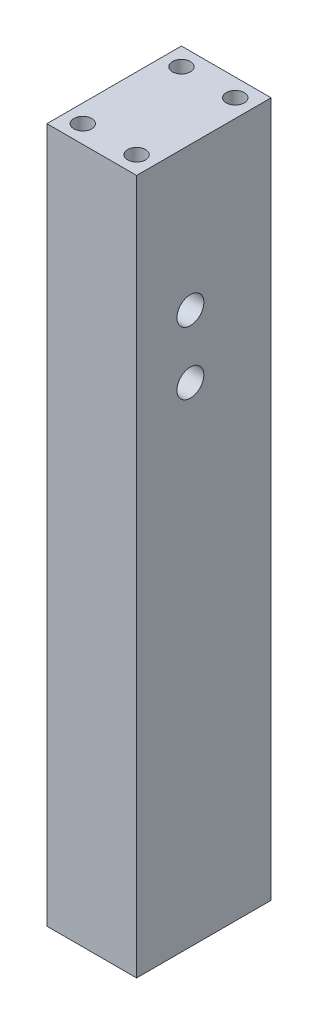
ISO-10303-21;
HEADER;
FILE_DESCRIPTION(('STEP AP214'),'2;1');
FILE_NAME('part.step','',(''),(''),'','','');
FILE_SCHEMA(('AUTOMOTIVE_DESIGN { 1 0 10303 214 1 1 1 1 }'));
ENDSEC;
DATA;
#1=APPLICATION_CONTEXT('core data for automotive mechanical design processes');
#2=APPLICATION_PROTOCOL_DEFINITION('international standard','automotive_design',2000,#1);
#3=PRODUCT_CONTEXT('',#1,'mechanical');
#4=PRODUCT('Part','Part','',(#3));
#5=PRODUCT_RELATED_PRODUCT_CATEGORY('part','',(#4));
#6=PRODUCT_DEFINITION_FORMATION('','',#4);
#7=PRODUCT_DEFINITION_CONTEXT('part definition',#1,'design');
#8=PRODUCT_DEFINITION('design','',#6,#7);
#9=PRODUCT_DEFINITION_SHAPE('','',#8);
#10=(LENGTH_UNIT() NAMED_UNIT(*) SI_UNIT(.MILLI.,.METRE.));
#11=(NAMED_UNIT(*) PLANE_ANGLE_UNIT() SI_UNIT($,.RADIAN.));
#12=(NAMED_UNIT(*) SI_UNIT($,.STERADIAN.) SOLID_ANGLE_UNIT());
#13=UNCERTAINTY_MEASURE_WITH_UNIT(LENGTH_MEASURE(1.E-05),#10,'distance_accuracy_value','');
#14=(GEOMETRIC_REPRESENTATION_CONTEXT(3) GLOBAL_UNCERTAINTY_ASSIGNED_CONTEXT((#13)) GLOBAL_UNIT_ASSIGNED_CONTEXT((#10,
#11,#12)) REPRESENTATION_CONTEXT('',''));
#15=CARTESIAN_POINT('',(0.,0.,0.));
#16=DIRECTION('',(0.,0.,1.));
#17=DIRECTION('',(1.,0.,0.));
#18=AXIS2_PLACEMENT_3D('',#15,#16,#17);
#19=CARTESIAN_POINT('',(10.,0.,0.));
#20=DIRECTION('',(-1.,0.,0.));
#21=DIRECTION('',(0.,0.,1.));
#22=AXIS2_PLACEMENT_3D('',#19,#20,#21);
#23=PLANE('',#22);
#24=DIRECTION('',(0.,-1.,0.));
#25=VECTOR('',#24,1.);
#26=CARTESIAN_POINT('',(10.,0.,0.));
#27=LINE('',#26,#25);
#28=CARTESIAN_POINT('',(10.,77.5,0.));
#29=VERTEX_POINT('',#28);
#30=CARTESIAN_POINT('',(10.,0.,0.));
#31=VERTEX_POINT('',#30);
#32=EDGE_CURVE('E84',#29,#31,#27,.T.);
#33=ORIENTED_EDGE('',*,*,#32,.T.);
#34=DIRECTION('',(0.,0.,-1.));
#35=VECTOR('',#34,1.);
#36=CARTESIAN_POINT('',(10.,0.,0.));
#37=LINE('',#36,#35);
#38=CARTESIAN_POINT('',(10.,0.,-15.));
#39=VERTEX_POINT('',#38);
#40=EDGE_CURVE('E79',#31,#39,#37,.T.);
#41=ORIENTED_EDGE('',*,*,#40,.T.);
#42=DIRECTION('',(0.,1.,0.));
#43=VECTOR('',#42,1.);
#44=CARTESIAN_POINT('',(10.,0.,-15.));
#45=LINE('',#44,#43);
#46=CARTESIAN_POINT('',(10.,77.5,-15.));
#47=VERTEX_POINT('',#46);
#48=EDGE_CURVE('E82',#39,#47,#45,.T.);
#49=ORIENTED_EDGE('',*,*,#48,.T.);
#50=DIRECTION('',(0.,0.,1.));
#51=VECTOR('',#50,1.);
#52=CARTESIAN_POINT('',(10.,77.5,0.));
#53=LINE('',#52,#51);
#54=EDGE_CURVE('E49',#47,#29,#53,.T.);
#55=ORIENTED_EDGE('',*,*,#54,.T.);
#56=EDGE_LOOP('',(#33,#41,#49,#55));
#57=FACE_BOUND('',#56,.T.);
#58=CARTESIAN_POINT('',(10.,54.5,-6.));
#59=DIRECTION('',(-1.,0.,0.));
#60=DIRECTION('',(0.,0.,1.));
#61=AXIS2_PLACEMENT_3D('',#58,#59,#60);
#62=CIRCLE('',#61,1.5);
#63=CARTESIAN_POINT('',(10.,54.5,-4.5));
#64=VERTEX_POINT('',#63);
#65=EDGE_CURVE('E163',#64,#64,#62,.T.);
#66=ORIENTED_EDGE('',*,*,#65,.T.);
#67=EDGE_LOOP('',(#66));
#68=FACE_BOUND('',#67,.T.);
#69=CARTESIAN_POINT('',(10.,61.5,-6.));
#70=DIRECTION('',(1.,0.,0.));
#71=DIRECTION('',(0.,0.,-1.));
#72=AXIS2_PLACEMENT_3D('',#69,#70,#71);
#73=CIRCLE('',#72,1.5);
#74=CARTESIAN_POINT('',(10.,61.5,-7.5));
#75=VERTEX_POINT('',#74);
#76=EDGE_CURVE('E166',#75,#75,#73,.T.);
#77=ORIENTED_EDGE('',*,*,#76,.F.);
#78=EDGE_LOOP('',(#77));
#79=FACE_BOUND('',#78,.T.);
#80=ADVANCED_FACE('F32',(#57,#68,#79),#23,.F.);
#81=CARTESIAN_POINT('',(10.,0.,0.));
#82=DIRECTION('',(0.,1.,0.));
#83=DIRECTION('',(0.,0.,1.));
#84=AXIS2_PLACEMENT_3D('',#81,#82,#83);
#85=PLANE('',#84);
#86=CARTESIAN_POINT('',(8.,0.,-13.));
#87=DIRECTION('',(0.,-1.,0.));
#88=DIRECTION('',(0.,0.,-1.));
#89=AXIS2_PLACEMENT_3D('',#86,#87,#88);
#90=CIRCLE('',#89,1.);
#91=CARTESIAN_POINT('',(8.,0.,-14.));
#92=VERTEX_POINT('',#91);
#93=EDGE_CURVE('E139',#92,#92,#90,.T.);
#94=ORIENTED_EDGE('',*,*,#93,.F.);
#95=EDGE_LOOP('',(#94));
#96=FACE_BOUND('',#95,.T.);
#97=CARTESIAN_POINT('',(8.,0.,-2.));
#98=DIRECTION('',(0.,-1.,0.));
#99=DIRECTION('',(0.,0.,-1.));
#100=AXIS2_PLACEMENT_3D('',#97,#98,#99);
#101=CIRCLE('',#100,1.);
#102=CARTESIAN_POINT('',(8.,0.,-3.));
#103=VERTEX_POINT('',#102);
#104=EDGE_CURVE('E136',#103,#103,#101,.F.);
#105=ORIENTED_EDGE('',*,*,#104,.T.);
#106=EDGE_LOOP('',(#105));
#107=FACE_BOUND('',#106,.T.);
#108=DIRECTION('',(0.,0.,-1.));
#109=VECTOR('',#108,1.);
#110=CARTESIAN_POINT('',(0.,0.,0.));
#111=LINE('',#110,#109);
#112=CARTESIAN_POINT('',(0.,0.,0.));
#113=VERTEX_POINT('',#112);
#114=CARTESIAN_POINT('',(0.,0.,-15.));
#115=VERTEX_POINT('',#114);
#116=EDGE_CURVE('E89',#113,#115,#111,.T.);
#117=ORIENTED_EDGE('',*,*,#116,.T.);
#118=DIRECTION('',(-1.,0.,0.));
#119=VECTOR('',#118,1.);
#120=CARTESIAN_POINT('',(10.,0.,-15.));
#121=LINE('',#120,#119);
#122=EDGE_CURVE('E41',#39,#115,#121,.T.);
#123=ORIENTED_EDGE('',*,*,#122,.F.);
#124=ORIENTED_EDGE('',*,*,#40,.F.);
#125=DIRECTION('',(-1.,0.,0.));
#126=VECTOR('',#125,1.);
#127=CARTESIAN_POINT('',(10.,0.,0.));
#128=LINE('',#127,#126);
#129=EDGE_CURVE('E11',#31,#113,#128,.T.);
#130=ORIENTED_EDGE('',*,*,#129,.T.);
#131=EDGE_LOOP('',(#117,#123,#124,#130));
#132=FACE_BOUND('',#131,.T.);
#133=CARTESIAN_POINT('',(2.,0.,-13.));
#134=DIRECTION('',(0.,-1.,0.));
#135=DIRECTION('',(0.,0.,-1.));
#136=AXIS2_PLACEMENT_3D('',#133,#134,#135);
#137=CIRCLE('',#136,1.);
#138=CARTESIAN_POINT('',(2.,0.,-14.));
#139=VERTEX_POINT('',#138);
#140=EDGE_CURVE('E152',#139,#139,#137,.F.);
#141=ORIENTED_EDGE('',*,*,#140,.T.);
#142=EDGE_LOOP('',(#141));
#143=FACE_BOUND('',#142,.T.);
#144=CARTESIAN_POINT('',(2.,0.,-2.));
#145=DIRECTION('',(0.,-1.,0.));
#146=DIRECTION('',(0.,0.,-1.));
#147=AXIS2_PLACEMENT_3D('',#144,#145,#146);
#148=CIRCLE('',#147,1.);
#149=CARTESIAN_POINT('',(2.,0.,-3.));
#150=VERTEX_POINT('',#149);
#151=EDGE_CURVE('E145',#150,#150,#148,.T.);
#152=ORIENTED_EDGE('',*,*,#151,.F.);
#153=EDGE_LOOP('',(#152));
#154=FACE_BOUND('',#153,.T.);
#155=ADVANCED_FACE('F87',(#96,#107,#132,#143,#154),#85,.F.);
#156=CARTESIAN_POINT('',(10.,77.5,0.));
#157=DIRECTION('',(0.,-1.,0.));
#158=DIRECTION('',(0.,0.,-1.));
#159=AXIS2_PLACEMENT_3D('',#156,#157,#158);
#160=PLANE('',#159);
#161=CARTESIAN_POINT('',(8.,77.5,-2.));
#162=DIRECTION('',(0.,1.,0.));
#163=DIRECTION('',(0.,0.,1.));
#164=AXIS2_PLACEMENT_3D('',#161,#162,#163);
#165=CIRCLE('',#164,1.);
#166=CARTESIAN_POINT('',(8.,77.5,-1.));
#167=VERTEX_POINT('',#166);
#168=EDGE_CURVE('E125',#167,#167,#165,.T.);
#169=ORIENTED_EDGE('',*,*,#168,.F.);
#170=EDGE_LOOP('',(#169));
#171=FACE_BOUND('',#170,.T.);
#172=CARTESIAN_POINT('',(2.,77.5,-13.));
#173=DIRECTION('',(0.,1.,0.));
#174=DIRECTION('',(0.,0.,1.));
#175=AXIS2_PLACEMENT_3D('',#172,#173,#174);
#176=CIRCLE('',#175,1.);
#177=CARTESIAN_POINT('',(2.,77.5,-12.));
#178=VERTEX_POINT('',#177);
#179=EDGE_CURVE('E112',#178,#178,#176,.T.);
#180=ORIENTED_EDGE('',*,*,#179,.F.);
#181=EDGE_LOOP('',(#180));
#182=FACE_BOUND('',#181,.T.);
#183=DIRECTION('',(0.,0.,1.));
#184=VECTOR('',#183,1.);
#185=CARTESIAN_POINT('',(0.,77.5,0.));
#186=LINE('',#185,#184);
#187=CARTESIAN_POINT('',(0.,77.5,-15.));
#188=VERTEX_POINT('',#187);
#189=CARTESIAN_POINT('',(0.,77.5,0.));
#190=VERTEX_POINT('',#189);
#191=EDGE_CURVE('E72',#188,#190,#186,.T.);
#192=ORIENTED_EDGE('',*,*,#191,.T.);
#193=DIRECTION('',(-1.,0.,0.));
#194=VECTOR('',#193,1.);
#195=CARTESIAN_POINT('',(10.,77.5,0.));
#196=LINE('',#195,#194);
#197=EDGE_CURVE('E93',#29,#190,#196,.T.);
#198=ORIENTED_EDGE('',*,*,#197,.F.);
#199=ORIENTED_EDGE('',*,*,#54,.F.);
#200=DIRECTION('',(-1.,0.,0.));
#201=VECTOR('',#200,1.);
#202=CARTESIAN_POINT('',(10.,77.5,-15.));
#203=LINE('',#202,#201);
#204=EDGE_CURVE('E90',#47,#188,#203,.T.);
#205=ORIENTED_EDGE('',*,*,#204,.T.);
#206=EDGE_LOOP('',(#192,#198,#199,#205));
#207=FACE_BOUND('',#206,.T.);
#208=CARTESIAN_POINT('',(8.,77.5,-13.));
#209=DIRECTION('',(0.,1.,0.));
#210=DIRECTION('',(0.,0.,1.));
#211=AXIS2_PLACEMENT_3D('',#208,#209,#210);
#212=CIRCLE('',#211,1.);
#213=CARTESIAN_POINT('',(8.,77.5,-12.));
#214=VERTEX_POINT('',#213);
#215=EDGE_CURVE('E131',#214,#214,#212,.F.);
#216=ORIENTED_EDGE('',*,*,#215,.T.);
#217=EDGE_LOOP('',(#216));
#218=FACE_BOUND('',#217,.T.);
#219=CARTESIAN_POINT('',(2.,77.5,-2.));
#220=DIRECTION('',(0.,1.,0.));
#221=DIRECTION('',(0.,0.,1.));
#222=AXIS2_PLACEMENT_3D('',#219,#220,#221);
#223=CIRCLE('',#222,1.);
#224=CARTESIAN_POINT('',(2.,77.5,-1.));
#225=VERTEX_POINT('',#224);
#226=EDGE_CURVE('E118',#225,#225,#223,.F.);
#227=ORIENTED_EDGE('',*,*,#226,.T.);
#228=EDGE_LOOP('',(#227));
#229=FACE_BOUND('',#228,.T.);
#230=ADVANCED_FACE('F105',(#171,#182,#207,#218,#229),#160,.F.);
#231=CARTESIAN_POINT('',(10.,0.,0.));
#232=DIRECTION('',(0.,0.,-1.));
#233=DIRECTION('',(-1.,0.,0.));
#234=AXIS2_PLACEMENT_3D('',#231,#232,#233);
#235=PLANE('',#234);
#236=DIRECTION('',(0.,-1.,0.));
#237=VECTOR('',#236,1.);
#238=CARTESIAN_POINT('',(0.,0.,0.));
#239=LINE('',#238,#237);
#240=EDGE_CURVE('E97',#190,#113,#239,.T.);
#241=ORIENTED_EDGE('',*,*,#240,.T.);
#242=ORIENTED_EDGE('',*,*,#129,.F.);
#243=ORIENTED_EDGE('',*,*,#32,.F.);
#244=ORIENTED_EDGE('',*,*,#197,.T.);
#245=EDGE_LOOP('',(#241,#242,#243,#244));
#246=FACE_BOUND('',#245,.T.);
#247=ADVANCED_FACE('F34',(#246),#235,.F.);
#248=CARTESIAN_POINT('',(10.,0.,-15.));
#249=DIRECTION('',(0.,0.,1.));
#250=DIRECTION('',(0.,-1.,0.));
#251=AXIS2_PLACEMENT_3D('',#248,#249,#250);
#252=PLANE('',#251);
#253=DIRECTION('',(0.,1.,0.));
#254=VECTOR('',#253,1.);
#255=CARTESIAN_POINT('',(0.,0.,-15.));
#256=LINE('',#255,#254);
#257=EDGE_CURVE('E66',#115,#188,#256,.T.);
#258=ORIENTED_EDGE('',*,*,#257,.T.);
#259=ORIENTED_EDGE('',*,*,#204,.F.);
#260=ORIENTED_EDGE('',*,*,#48,.F.);
#261=ORIENTED_EDGE('',*,*,#122,.T.);
#262=EDGE_LOOP('',(#258,#259,#260,#261));
#263=FACE_BOUND('',#262,.T.);
#264=ADVANCED_FACE('F91',(#263),#252,.F.);
#265=CARTESIAN_POINT('',(0.,0.,0.));
#266=DIRECTION('',(-1.,0.,0.));
#267=DIRECTION('',(0.,0.,1.));
#268=AXIS2_PLACEMENT_3D('',#265,#266,#267);
#269=PLANE('',#268);
#270=ORIENTED_EDGE('',*,*,#240,.F.);
#271=ORIENTED_EDGE('',*,*,#191,.F.);
#272=ORIENTED_EDGE('',*,*,#257,.F.);
#273=ORIENTED_EDGE('',*,*,#116,.F.);
#274=EDGE_LOOP('',(#270,#271,#272,#273));
#275=FACE_BOUND('',#274,.T.);
#276=ADVANCED_FACE('F109',(#275),#269,.T.);
#277=CARTESIAN_POINT('',(2.,67.5,-13.));
#278=DIRECTION('',(0.,1.,0.));
#279=DIRECTION('',(0.,0.,1.));
#280=AXIS2_PLACEMENT_3D('',#277,#278,#279);
#281=CYLINDRICAL_SURFACE('',#280,1.);
#282=CARTESIAN_POINT('',(2.,67.5,-13.));
#283=DIRECTION('',(0.,1.,0.));
#284=DIRECTION('',(0.,0.,1.));
#285=AXIS2_PLACEMENT_3D('',#282,#283,#284);
#286=CIRCLE('',#285,1.);
#287=CARTESIAN_POINT('',(2.,67.5,-12.));
#288=VERTEX_POINT('',#287);
#289=EDGE_CURVE('E100',#288,#288,#286,.T.);
#290=ORIENTED_EDGE('',*,*,#289,.F.);
#291=EDGE_LOOP('',(#290));
#292=FACE_BOUND('',#291,.T.);
#293=ORIENTED_EDGE('',*,*,#179,.T.);
#294=EDGE_LOOP('',(#293));
#295=FACE_BOUND('',#294,.T.);
#296=ADVANCED_FACE('F189',(#292,#295),#281,.F.);
#297=CARTESIAN_POINT('',(0.,67.5,0.));
#298=DIRECTION('',(0.,1.,0.));
#299=DIRECTION('',(0.,0.,1.));
#300=AXIS2_PLACEMENT_3D('',#297,#298,#299);
#301=PLANE('',#300);
#302=ORIENTED_EDGE('',*,*,#289,.T.);
#303=EDGE_LOOP('',(#302));
#304=FACE_BOUND('',#303,.T.);
#305=ADVANCED_FACE('F348',(#304),#301,.T.);
#306=CARTESIAN_POINT('',(8.,67.5,-13.));
#307=DIRECTION('',(0.,1.,0.));
#308=DIRECTION('',(0.,0.,1.));
#309=AXIS2_PLACEMENT_3D('',#306,#307,#308);
#310=CYLINDRICAL_SURFACE('',#309,1.);
#311=CARTESIAN_POINT('',(8.,67.5,-13.));
#312=DIRECTION('',(0.,1.,0.));
#313=DIRECTION('',(0.,0.,1.));
#314=AXIS2_PLACEMENT_3D('',#311,#312,#313);
#315=CIRCLE('',#314,1.);
#316=CARTESIAN_POINT('',(8.,67.5,-12.));
#317=VERTEX_POINT('',#316);
#318=EDGE_CURVE('E115',#317,#317,#315,.F.);
#319=ORIENTED_EDGE('',*,*,#318,.T.);
#320=EDGE_LOOP('',(#319));
#321=FACE_BOUND('',#320,.T.);
#322=ORIENTED_EDGE('',*,*,#215,.F.);
#323=EDGE_LOOP('',(#322));
#324=FACE_BOUND('',#323,.T.);
#325=ADVANCED_FACE('F344',(#321,#324),#310,.F.);
#326=CARTESIAN_POINT('',(0.,67.5,0.));
#327=DIRECTION('',(0.,1.,0.));
#328=DIRECTION('',(0.,0.,1.));
#329=AXIS2_PLACEMENT_3D('',#326,#327,#328);
#330=PLANE('',#329);
#331=ORIENTED_EDGE('',*,*,#318,.F.);
#332=EDGE_LOOP('',(#331));
#333=FACE_BOUND('',#332,.T.);
#334=ADVANCED_FACE('F340',(#333),#330,.T.);
#335=CARTESIAN_POINT('',(8.,67.5,-2.));
#336=DIRECTION('',(0.,1.,0.));
#337=DIRECTION('',(0.,0.,1.));
#338=AXIS2_PLACEMENT_3D('',#335,#336,#337);
#339=CYLINDRICAL_SURFACE('',#338,1.);
#340=CARTESIAN_POINT('',(8.,67.5,-2.));
#341=DIRECTION('',(0.,1.,0.));
#342=DIRECTION('',(0.,0.,1.));
#343=AXIS2_PLACEMENT_3D('',#340,#341,#342);
#344=CIRCLE('',#343,1.);
#345=CARTESIAN_POINT('',(8.,67.5,-1.));
#346=VERTEX_POINT('',#345);
#347=EDGE_CURVE('E128',#346,#346,#344,.T.);
#348=ORIENTED_EDGE('',*,*,#347,.F.);
#349=EDGE_LOOP('',(#348));
#350=FACE_BOUND('',#349,.T.);
#351=ORIENTED_EDGE('',*,*,#168,.T.);
#352=EDGE_LOOP('',(#351));
#353=FACE_BOUND('',#352,.T.);
#354=ADVANCED_FACE('F343',(#350,#353),#339,.F.);
#355=CARTESIAN_POINT('',(0.,67.5,0.));
#356=DIRECTION('',(0.,1.,0.));
#357=DIRECTION('',(0.,0.,1.));
#358=AXIS2_PLACEMENT_3D('',#355,#356,#357);
#359=PLANE('',#358);
#360=ORIENTED_EDGE('',*,*,#347,.T.);
#361=EDGE_LOOP('',(#360));
#362=FACE_BOUND('',#361,.T.);
#363=ADVANCED_FACE('F350',(#362),#359,.T.);
#364=CARTESIAN_POINT('',(2.,67.5,-2.));
#365=DIRECTION('',(0.,1.,0.));
#366=DIRECTION('',(0.,0.,1.));
#367=AXIS2_PLACEMENT_3D('',#364,#365,#366);
#368=CYLINDRICAL_SURFACE('',#367,1.);
#369=CARTESIAN_POINT('',(2.,67.5,-2.));
#370=DIRECTION('',(0.,1.,0.));
#371=DIRECTION('',(0.,0.,1.));
#372=AXIS2_PLACEMENT_3D('',#369,#370,#371);
#373=CIRCLE('',#372,1.);
#374=CARTESIAN_POINT('',(2.,67.5,-1.));
#375=VERTEX_POINT('',#374);
#376=EDGE_CURVE('E121',#375,#375,#373,.F.);
#377=ORIENTED_EDGE('',*,*,#376,.T.);
#378=EDGE_LOOP('',(#377));
#379=FACE_BOUND('',#378,.T.);
#380=ORIENTED_EDGE('',*,*,#226,.F.);
#381=EDGE_LOOP('',(#380));
#382=FACE_BOUND('',#381,.T.);
#383=ADVANCED_FACE('F353',(#379,#382),#368,.F.);
#384=CARTESIAN_POINT('',(0.,67.5,0.));
#385=DIRECTION('',(0.,1.,0.));
#386=DIRECTION('',(0.,0.,1.));
#387=AXIS2_PLACEMENT_3D('',#384,#385,#386);
#388=PLANE('',#387);
#389=ORIENTED_EDGE('',*,*,#376,.F.);
#390=EDGE_LOOP('',(#389));
#391=FACE_BOUND('',#390,.T.);
#392=ADVANCED_FACE('F220',(#391),#388,.T.);
#393=CARTESIAN_POINT('',(8.,10.,-2.));
#394=DIRECTION('',(0.,-1.,0.));
#395=DIRECTION('',(0.,0.,-1.));
#396=AXIS2_PLACEMENT_3D('',#393,#394,#395);
#397=CYLINDRICAL_SURFACE('',#396,1.);
#398=CARTESIAN_POINT('',(8.,10.,-2.));
#399=DIRECTION('',(0.,-1.,0.));
#400=DIRECTION('',(0.,0.,-1.));
#401=AXIS2_PLACEMENT_3D('',#398,#399,#400);
#402=CIRCLE('',#401,1.);
#403=CARTESIAN_POINT('',(8.,10.,-3.));
#404=VERTEX_POINT('',#403);
#405=EDGE_CURVE('E122',#404,#404,#402,.F.);
#406=ORIENTED_EDGE('',*,*,#405,.T.);
#407=EDGE_LOOP('',(#406));
#408=FACE_BOUND('',#407,.T.);
#409=ORIENTED_EDGE('',*,*,#104,.F.);
#410=EDGE_LOOP('',(#409));
#411=FACE_BOUND('',#410,.T.);
#412=ADVANCED_FACE('F224',(#408,#411),#397,.F.);
#413=CARTESIAN_POINT('',(0.,10.,0.));
#414=DIRECTION('',(0.,-1.,0.));
#415=DIRECTION('',(0.,0.,-1.));
#416=AXIS2_PLACEMENT_3D('',#413,#414,#415);
#417=PLANE('',#416);
#418=ORIENTED_EDGE('',*,*,#405,.F.);
#419=EDGE_LOOP('',(#418));
#420=FACE_BOUND('',#419,.T.);
#421=ADVANCED_FACE('F228',(#420),#417,.T.);
#422=CARTESIAN_POINT('',(8.,10.,-13.));
#423=DIRECTION('',(0.,-1.,0.));
#424=DIRECTION('',(0.,0.,-1.));
#425=AXIS2_PLACEMENT_3D('',#422,#423,#424);
#426=CYLINDRICAL_SURFACE('',#425,1.);
#427=CARTESIAN_POINT('',(8.,10.,-13.));
#428=DIRECTION('',(0.,-1.,0.));
#429=DIRECTION('',(0.,0.,-1.));
#430=AXIS2_PLACEMENT_3D('',#427,#428,#429);
#431=CIRCLE('',#430,1.);
#432=CARTESIAN_POINT('',(8.,10.,-14.));
#433=VERTEX_POINT('',#432);
#434=EDGE_CURVE('E155',#433,#433,#431,.T.);
#435=ORIENTED_EDGE('',*,*,#434,.F.);
#436=EDGE_LOOP('',(#435));
#437=FACE_BOUND('',#436,.T.);
#438=ORIENTED_EDGE('',*,*,#93,.T.);
#439=EDGE_LOOP('',(#438));
#440=FACE_BOUND('',#439,.T.);
#441=ADVANCED_FACE('F238',(#437,#440),#426,.F.);
#442=CARTESIAN_POINT('',(0.,10.,0.));
#443=DIRECTION('',(0.,-1.,0.));
#444=DIRECTION('',(0.,0.,-1.));
#445=AXIS2_PLACEMENT_3D('',#442,#443,#444);
#446=PLANE('',#445);
#447=ORIENTED_EDGE('',*,*,#434,.T.);
#448=EDGE_LOOP('',(#447));
#449=FACE_BOUND('',#448,.T.);
#450=ADVANCED_FACE('F248',(#449),#446,.T.);
#451=CARTESIAN_POINT('',(2.,10.,-13.));
#452=DIRECTION('',(0.,-1.,0.));
#453=DIRECTION('',(0.,0.,-1.));
#454=AXIS2_PLACEMENT_3D('',#451,#452,#453);
#455=CYLINDRICAL_SURFACE('',#454,1.);
#456=CARTESIAN_POINT('',(2.,10.,-13.));
#457=DIRECTION('',(0.,-1.,0.));
#458=DIRECTION('',(0.,0.,-1.));
#459=AXIS2_PLACEMENT_3D('',#456,#457,#458);
#460=CIRCLE('',#459,1.);
#461=CARTESIAN_POINT('',(2.,10.,-14.));
#462=VERTEX_POINT('',#461);
#463=EDGE_CURVE('E149',#462,#462,#460,.F.);
#464=ORIENTED_EDGE('',*,*,#463,.T.);
#465=EDGE_LOOP('',(#464));
#466=FACE_BOUND('',#465,.T.);
#467=ORIENTED_EDGE('',*,*,#140,.F.);
#468=EDGE_LOOP('',(#467));
#469=FACE_BOUND('',#468,.T.);
#470=ADVANCED_FACE('F258',(#466,#469),#455,.F.);
#471=CARTESIAN_POINT('',(0.,10.,0.));
#472=DIRECTION('',(0.,-1.,0.));
#473=DIRECTION('',(0.,0.,-1.));
#474=AXIS2_PLACEMENT_3D('',#471,#472,#473);
#475=PLANE('',#474);
#476=ORIENTED_EDGE('',*,*,#463,.F.);
#477=EDGE_LOOP('',(#476));
#478=FACE_BOUND('',#477,.T.);
#479=ADVANCED_FACE('F268',(#478),#475,.T.);
#480=CARTESIAN_POINT('',(2.,10.,-2.));
#481=DIRECTION('',(0.,-1.,0.));
#482=DIRECTION('',(0.,0.,-1.));
#483=AXIS2_PLACEMENT_3D('',#480,#481,#482);
#484=CYLINDRICAL_SURFACE('',#483,1.);
#485=CARTESIAN_POINT('',(2.,10.,-2.));
#486=DIRECTION('',(0.,-1.,0.));
#487=DIRECTION('',(0.,0.,-1.));
#488=AXIS2_PLACEMENT_3D('',#485,#486,#487);
#489=CIRCLE('',#488,1.);
#490=CARTESIAN_POINT('',(2.,10.,-3.));
#491=VERTEX_POINT('',#490);
#492=EDGE_CURVE('E142',#491,#491,#489,.T.);
#493=ORIENTED_EDGE('',*,*,#492,.F.);
#494=EDGE_LOOP('',(#493));
#495=FACE_BOUND('',#494,.T.);
#496=ORIENTED_EDGE('',*,*,#151,.T.);
#497=EDGE_LOOP('',(#496));
#498=FACE_BOUND('',#497,.T.);
#499=ADVANCED_FACE('F278',(#495,#498),#484,.F.);
#500=CARTESIAN_POINT('',(2.,10.,-2.));
#501=DIRECTION('',(0.,-1.,0.));
#502=DIRECTION('',(0.,0.,-1.));
#503=AXIS2_PLACEMENT_3D('',#500,#501,#502);
#504=PLANE('',#503);
#505=ORIENTED_EDGE('',*,*,#492,.T.);
#506=EDGE_LOOP('',(#505));
#507=FACE_BOUND('',#506,.T.);
#508=ADVANCED_FACE('F288',(#507),#504,.T.);
#509=CARTESIAN_POINT('',(5.,54.5,-6.));
#510=DIRECTION('',(1.,0.,0.));
#511=DIRECTION('',(0.,0.,-1.));
#512=AXIS2_PLACEMENT_3D('',#509,#510,#511);
#513=CYLINDRICAL_SURFACE('',#512,1.5);
#514=CARTESIAN_POINT('',(5.,54.5,-6.));
#515=DIRECTION('',(-1.,0.,0.));
#516=DIRECTION('',(0.,0.,1.));
#517=AXIS2_PLACEMENT_3D('',#514,#515,#516);
#518=CIRCLE('',#517,1.5);
#519=CARTESIAN_POINT('',(5.,54.5,-4.5));
#520=VERTEX_POINT('',#519);
#521=EDGE_CURVE('E160',#520,#520,#518,.T.);
#522=ORIENTED_EDGE('',*,*,#521,.T.);
#523=EDGE_LOOP('',(#522));
#524=FACE_BOUND('',#523,.T.);
#525=ORIENTED_EDGE('',*,*,#65,.F.);
#526=EDGE_LOOP('',(#525));
#527=FACE_BOUND('',#526,.T.);
#528=ADVANCED_FACE('F297',(#524,#527),#513,.F.);
#529=CARTESIAN_POINT('',(5.,54.5,-6.));
#530=DIRECTION('',(-1.,0.,0.));
#531=DIRECTION('',(0.,0.,1.));
#532=AXIS2_PLACEMENT_3D('',#529,#530,#531);
#533=PLANE('',#532);
#534=ORIENTED_EDGE('',*,*,#521,.F.);
#535=EDGE_LOOP('',(#534));
#536=FACE_BOUND('',#535,.T.);
#537=ADVANCED_FACE('F177',(#536),#533,.F.);
#538=CARTESIAN_POINT('',(5.,61.5,-6.));
#539=DIRECTION('',(1.,0.,0.));
#540=DIRECTION('',(0.,0.,-1.));
#541=AXIS2_PLACEMENT_3D('',#538,#539,#540);
#542=CYLINDRICAL_SURFACE('',#541,1.5);
#543=CARTESIAN_POINT('',(5.,61.5,-6.));
#544=DIRECTION('',(1.,0.,0.));
#545=DIRECTION('',(0.,0.,-1.));
#546=AXIS2_PLACEMENT_3D('',#543,#544,#545);
#547=CIRCLE('',#546,1.5);
#548=CARTESIAN_POINT('',(5.,61.5,-7.5));
#549=VERTEX_POINT('',#548);
#550=EDGE_CURVE('E146',#549,#549,#547,.T.);
#551=ORIENTED_EDGE('',*,*,#550,.F.);
#552=EDGE_LOOP('',(#551));
#553=FACE_BOUND('',#552,.T.);
#554=ORIENTED_EDGE('',*,*,#76,.T.);
#555=EDGE_LOOP('',(#554));
#556=FACE_BOUND('',#555,.T.);
#557=ADVANCED_FACE('F174',(#553,#556),#542,.F.);
#558=CARTESIAN_POINT('',(5.,61.5,-6.));
#559=DIRECTION('',(1.,0.,0.));
#560=DIRECTION('',(0.,0.,-1.));
#561=AXIS2_PLACEMENT_3D('',#558,#559,#560);
#562=PLANE('',#561);
#563=ORIENTED_EDGE('',*,*,#550,.T.);
#564=EDGE_LOOP('',(#563));
#565=FACE_BOUND('',#564,.T.);
#566=ADVANCED_FACE('F172',(#565),#562,.T.);
#567=CLOSED_SHELL('',(#80,#155,#230,#247,#264,#276,#296,#305,#325,#334,#354,#363,#383,#392,#412,
#421,#441,#450,#470,#479,#499,#508,#528,#537,#557,#566));
#568=MANIFOLD_SOLID_BREP('B2',#567);
#569=ADVANCED_BREP_SHAPE_REPRESENTATION('',(#18,#568),#14);
#570=SHAPE_DEFINITION_REPRESENTATION(#9,#569);
ENDSEC;
END-ISO-10303-21;
